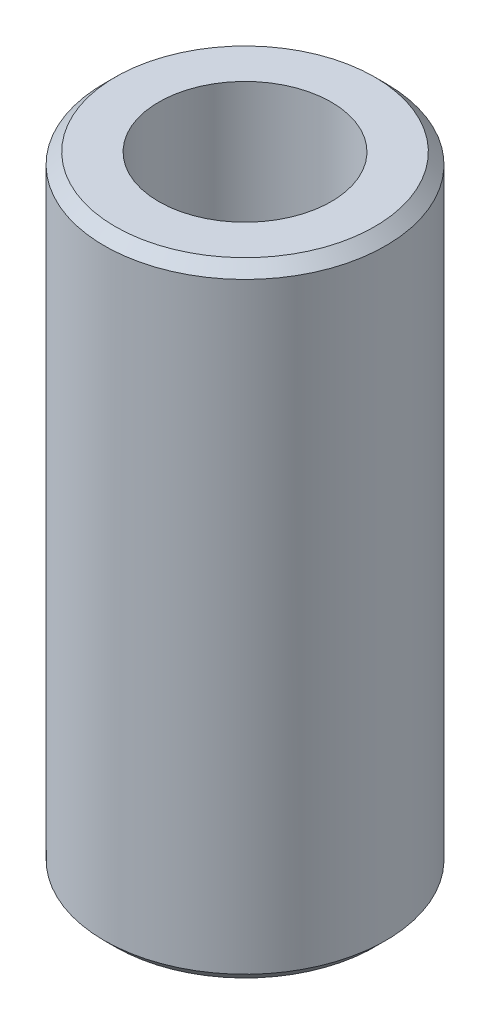
ISO-10303-21;
HEADER;
FILE_DESCRIPTION(('STEP AP214'),'2;1');
FILE_NAME('part.step','',(''),(''),'','','');
FILE_SCHEMA(('AUTOMOTIVE_DESIGN { 1 0 10303 214 1 1 1 1 }'));
ENDSEC;
DATA;
#1=APPLICATION_CONTEXT('core data for automotive mechanical design processes');
#2=APPLICATION_PROTOCOL_DEFINITION('international standard','automotive_design',2000,#1);
#3=PRODUCT_CONTEXT('',#1,'mechanical');
#4=PRODUCT('Part','Part','',(#3));
#5=PRODUCT_RELATED_PRODUCT_CATEGORY('part','',(#4));
#6=PRODUCT_DEFINITION_FORMATION('','',#4);
#7=PRODUCT_DEFINITION_CONTEXT('part definition',#1,'design');
#8=PRODUCT_DEFINITION('design','',#6,#7);
#9=PRODUCT_DEFINITION_SHAPE('','',#8);
#10=(LENGTH_UNIT() NAMED_UNIT(*) SI_UNIT(.MILLI.,.METRE.));
#11=(NAMED_UNIT(*) PLANE_ANGLE_UNIT() SI_UNIT($,.RADIAN.));
#12=(NAMED_UNIT(*) SI_UNIT($,.STERADIAN.) SOLID_ANGLE_UNIT());
#13=UNCERTAINTY_MEASURE_WITH_UNIT(LENGTH_MEASURE(1.E-05),#10,'distance_accuracy_value','');
#14=(GEOMETRIC_REPRESENTATION_CONTEXT(3) GLOBAL_UNCERTAINTY_ASSIGNED_CONTEXT((#13)) GLOBAL_UNIT_ASSIGNED_CONTEXT((#10,
#11,#12)) REPRESENTATION_CONTEXT('',''));
#15=CARTESIAN_POINT('',(0.,0.,0.));
#16=DIRECTION('',(0.,0.,1.));
#17=DIRECTION('',(1.,0.,0.));
#18=AXIS2_PLACEMENT_3D('',#15,#16,#17);
#19=CARTESIAN_POINT('',(0.,221.68163707225,0.));
#20=DIRECTION('',(0.,-1.,0.));
#21=DIRECTION('',(0.,0.,-1.));
#22=AXIS2_PLACEMENT_3D('',#19,#20,#21);
#23=CYLINDRICAL_SURFACE('',#22,50.);
#24=CARTESIAN_POINT('',(0.,217.753689113796,0.));
#25=DIRECTION('',(0.,1.,0.));
#26=DIRECTION('',(0.,0.,1.));
#27=AXIS2_PLACEMENT_3D('',#24,#25,#26);
#28=CIRCLE('',#27,50.);
#29=CARTESIAN_POINT('',(0.,217.753689113796,-50.));
#30=VERTEX_POINT('',#29);
#31=EDGE_CURVE('E50',#30,#30,#28,.F.);
#32=CARTESIAN_POINT('',(0.,3.92794795845428,0.));
#33=DIRECTION('',(0.,1.,0.));
#34=DIRECTION('',(0.,0.,1.));
#35=AXIS2_PLACEMENT_3D('',#32,#33,#34);
#36=CIRCLE('',#35,50.);
#37=CARTESIAN_POINT('',(0.,3.92794795845425,-50.));
#38=VERTEX_POINT('',#37);
#39=EDGE_CURVE('E51',#38,#38,#36,.T.);
#40=CARTESIAN_POINT('',(0.,217.753689113796,-50.));
#41=CARTESIAN_POINT('',(0.,215.526337643428,-50.));
#42=CARTESIAN_POINT('',(0.,213.29898617306,-50.));
#43=CARTESIAN_POINT('',(0.,208.844283232323,-50.));
#44=CARTESIAN_POINT('',(0.,206.616931761955,-50.));
#45=CARTESIAN_POINT('',(0.,202.162228821219,-50.));
#46=CARTESIAN_POINT('',(0.,199.934877350851,-50.));
#47=CARTESIAN_POINT('',(0.,195.480174410115,-50.));
#48=CARTESIAN_POINT('',(0.,193.252822939746,-50.));
#49=CARTESIAN_POINT('',(0.,188.79811999901,-50.));
#50=CARTESIAN_POINT('',(0.,186.570768528642,-50.));
#51=CARTESIAN_POINT('',(0.,182.116065587906,-50.));
#52=CARTESIAN_POINT('',(0.,179.888714117538,-50.));
#53=CARTESIAN_POINT('',(0.,175.434011176801,-50.));
#54=CARTESIAN_POINT('',(0.,173.206659706433,-50.));
#55=CARTESIAN_POINT('',(0.,168.751956765697,-50.));
#56=CARTESIAN_POINT('',(0.,166.524605295329,-50.));
#57=CARTESIAN_POINT('',(0.,162.069902354592,-50.));
#58=CARTESIAN_POINT('',(0.,159.842550884224,-50.));
#59=CARTESIAN_POINT('',(0.,155.387847943488,-50.));
#60=CARTESIAN_POINT('',(0.,153.16049647312,-50.));
#61=CARTESIAN_POINT('',(0.,148.705793532384,-50.));
#62=CARTESIAN_POINT('',(0.,146.478442062015,-50.));
#63=CARTESIAN_POINT('',(0.,142.023739121279,-50.));
#64=CARTESIAN_POINT('',(0.,139.796387650911,-50.));
#65=CARTESIAN_POINT('',(0.,135.341684710175,-50.));
#66=CARTESIAN_POINT('',(0.,133.114333239807,-50.));
#67=CARTESIAN_POINT('',(0.,128.65963029907,-50.));
#68=CARTESIAN_POINT('',(0.,126.432278828702,-50.));
#69=CARTESIAN_POINT('',(0.,121.977575887966,-50.));
#70=CARTESIAN_POINT('',(0.,119.750224417598,-50.));
#71=CARTESIAN_POINT('',(0.,115.295521476861,-50.));
#72=CARTESIAN_POINT('',(0.,113.068170006493,-50.));
#73=CARTESIAN_POINT('',(0.,108.613467065757,-50.));
#74=CARTESIAN_POINT('',(0.,106.386115595389,-50.));
#75=CARTESIAN_POINT('',(0.,101.931412654653,-50.));
#76=CARTESIAN_POINT('',(0.,99.7040611842844,-50.));
#77=CARTESIAN_POINT('',(0.,95.2493582435481,-50.));
#78=CARTESIAN_POINT('',(0.,93.02200677318,-50.));
#79=CARTESIAN_POINT('',(0.,88.5673038324437,-50.));
#80=CARTESIAN_POINT('',(0.,86.3399523620755,-50.));
#81=CARTESIAN_POINT('',(0.,81.8852494213393,-50.));
#82=CARTESIAN_POINT('',(0.,79.6578979509711,-50.));
#83=CARTESIAN_POINT('',(0.,75.2031950102348,-50.));
#84=CARTESIAN_POINT('',(0.,72.9758435398667,-50.));
#85=CARTESIAN_POINT('',(0.,68.5211405991304,-50.));
#86=CARTESIAN_POINT('',(0.,66.2937891287622,-50.));
#87=CARTESIAN_POINT('',(0.,61.839086188026,-50.));
#88=CARTESIAN_POINT('',(0.,59.6117347176578,-50.));
#89=CARTESIAN_POINT('',(0.,55.1570317769215,-50.));
#90=CARTESIAN_POINT('',(0.,52.9296803065534,-50.));
#91=CARTESIAN_POINT('',(0.,48.4749773658171,-50.));
#92=CARTESIAN_POINT('',(0.,46.247625895449,-50.));
#93=CARTESIAN_POINT('',(0.,41.7929229547127,-50.));
#94=CARTESIAN_POINT('',(0.,39.5655714843445,-50.));
#95=CARTESIAN_POINT('',(0.,35.1108685436082,-50.));
#96=CARTESIAN_POINT('',(0.,32.8835170732401,-50.));
#97=CARTESIAN_POINT('',(0.,28.4288141325038,-50.));
#98=CARTESIAN_POINT('',(0.,26.2014626621357,-50.));
#99=CARTESIAN_POINT('',(0.,21.7467597213994,-50.));
#100=CARTESIAN_POINT('',(0.,19.5194082510312,-50.));
#101=CARTESIAN_POINT('',(0.,15.064705310295,-50.));
#102=CARTESIAN_POINT('',(0.,12.8373538399268,-50.));
#103=CARTESIAN_POINT('',(0.,8.38265089919053,-50.));
#104=CARTESIAN_POINT('',(0.,6.15529942882239,-50.));
#105=CARTESIAN_POINT('',(0.,3.92794795845425,-50.));
#106=B_SPLINE_CURVE_WITH_KNOTS('',3,(#40,#41,#42,#43,#44,#45,#46,#47,#48,#49,#50,#51,#52,#53,
#54,#55,#56,#57,#58,#59,#60,#61,#62,#63,#64,#65,#66,#67,#68,#69,#70,#71,#72,#73,#74,#75,#76,#77,
#78,#79,#80,#81,#82,#83,#84,#85,#86,#87,#88,#89,#90,#91,#92,#93,#94,#95,#96,#97,#98,#99,#100,
#101,#102,#103,#104,#105),.UNSPECIFIED.,.F.,.F.,(4,2,2,2,2,2,2,2,2,2,2,2,2,2,2,2,2,2,2,2,2,2,2,
2,2,2,2,2,2,2,2,2,4),(0.,6.68205441110442,13.3641088222088,20.0461632333133,26.7282176444177,
33.4102720555221,40.0923264666266,46.774380877731,53.4564352888354,60.1384896999398,
66.8205441110442,73.5025985221487,80.1846529332531,86.8667073443575,93.548761755462,
100.230816166566,106.912870577671,113.594924988775,120.27697939988,126.959033810984,
133.641088222089,140.323142633193,147.005197044297,153.687251455402,160.369305866506,
167.051360277611,173.733414688715,180.41546909982,187.097523510924,193.779577922028,
200.461632333133,207.143686744237,213.825741155342),.UNSPECIFIED.);
#107=EDGE_CURVE('BSEAM39',#30,#38,#106,.T.);
#108=ORIENTED_EDGE('',*,*,#31,.T.);
#109=ORIENTED_EDGE('',*,*,#39,.T.);
#110=ORIENTED_EDGE('',*,*,#107,.T.);
#111=ORIENTED_EDGE('',*,*,#107,.F.);
#112=EDGE_LOOP('',(#108,#110,#109,#111));
#113=FACE_BOUND('',#112,.T.);
#114=ADVANCED_FACE('F39',(#113),#23,.T.);
#115=CARTESIAN_POINT('',(0.,221.68163707225,0.));
#116=DIRECTION('',(0.,1.,0.));
#117=DIRECTION('',(0.,0.,1.));
#118=AXIS2_PLACEMENT_3D('',#115,#116,#117);
#119=PLANE('',#118);
#120=CARTESIAN_POINT('',(0.,221.68163707225,0.));
#121=DIRECTION('',(0.,1.,0.));
#122=DIRECTION('',(0.,0.,1.));
#123=AXIS2_PLACEMENT_3D('',#120,#121,#122);
#124=CIRCLE('',#123,46.072052041546);
#125=CARTESIAN_POINT('',(0.,221.68163707225,46.072052041546));
#126=VERTEX_POINT('',#125);
#127=EDGE_CURVE('E54',#126,#126,#124,.T.);
#128=ORIENTED_EDGE('',*,*,#127,.T.);
#129=EDGE_LOOP('',(#128));
#130=FACE_BOUND('',#129,.T.);
#131=CARTESIAN_POINT('',(0.,221.68163707225,0.));
#132=DIRECTION('',(0.,1.,0.));
#133=DIRECTION('',(0.,0.,1.));
#134=AXIS2_PLACEMENT_3D('',#131,#132,#133);
#135=CIRCLE('',#134,30.6544891111135);
#136=CARTESIAN_POINT('',(0.,221.68163707225,-30.6544891111135));
#137=VERTEX_POINT('',#136);
#138=EDGE_CURVE('E58',#137,#137,#135,.T.);
#139=ORIENTED_EDGE('',*,*,#138,.F.);
#140=EDGE_LOOP('',(#139));
#141=FACE_BOUND('',#140,.T.);
#142=ADVANCED_FACE('F69',(#130,#141),#119,.T.);
#143=CARTESIAN_POINT('',(0.,0.,0.));
#144=DIRECTION('',(0.,1.,0.));
#145=DIRECTION('',(0.,0.,1.));
#146=AXIS2_PLACEMENT_3D('',#143,#144,#145);
#147=PLANE('',#146);
#148=CARTESIAN_POINT('',(0.,0.,0.));
#149=DIRECTION('',(0.,1.,0.));
#150=DIRECTION('',(0.,0.,1.));
#151=AXIS2_PLACEMENT_3D('',#148,#149,#150);
#152=CIRCLE('',#151,46.0720520415457);
#153=CARTESIAN_POINT('',(0.,0.,46.0720520415457));
#154=VERTEX_POINT('',#153);
#155=EDGE_CURVE('E10',#154,#154,#152,.F.);
#156=ORIENTED_EDGE('',*,*,#155,.T.);
#157=EDGE_LOOP('',(#156));
#158=FACE_BOUND('',#157,.T.);
#159=CARTESIAN_POINT('',(0.,0.,0.));
#160=DIRECTION('',(0.,1.,0.));
#161=DIRECTION('',(0.,0.,1.));
#162=AXIS2_PLACEMENT_3D('',#159,#160,#161);
#163=CIRCLE('',#162,30.6544891111135);
#164=CARTESIAN_POINT('',(0.,0.,-30.6544891111135));
#165=VERTEX_POINT('',#164);
#166=EDGE_CURVE('E63',#165,#165,#163,.T.);
#167=ORIENTED_EDGE('',*,*,#166,.T.);
#168=EDGE_LOOP('',(#167));
#169=FACE_BOUND('',#168,.T.);
#170=ADVANCED_FACE('F75',(#158,#169),#147,.F.);
#171=CARTESIAN_POINT('',(0.,221.68163707225,0.));
#172=DIRECTION('',(0.,-1.,0.));
#173=DIRECTION('',(0.,0.,-1.));
#174=AXIS2_PLACEMENT_3D('',#171,#172,#173);
#175=CYLINDRICAL_SURFACE('',#174,30.6544891111135);
#176=CARTESIAN_POINT('',(0.,221.68163707225,-30.6544891111135));
#177=CARTESIAN_POINT('',(0.,219.372453352747,-30.6544891111135));
#178=CARTESIAN_POINT('',(0.,217.063269633245,-30.6544891111135));
#179=CARTESIAN_POINT('',(0.,212.44490219424,-30.6544891111135));
#180=CARTESIAN_POINT('',(0.,210.135718474737,-30.6544891111135));
#181=CARTESIAN_POINT('',(0.,205.517351035732,-30.6544891111135));
#182=CARTESIAN_POINT('',(0.,203.208167316229,-30.6544891111135));
#183=CARTESIAN_POINT('',(0.,198.589799877224,-30.6544891111135));
#184=CARTESIAN_POINT('',(0.,196.280616157721,-30.6544891111135));
#185=CARTESIAN_POINT('',(0.,191.662248718716,-30.6544891111135));
#186=CARTESIAN_POINT('',(0.,189.353064999213,-30.6544891111135));
#187=CARTESIAN_POINT('',(0.,184.734697560208,-30.6544891111135));
#188=CARTESIAN_POINT('',(0.,182.425513840706,-30.6544891111135));
#189=CARTESIAN_POINT('',(0.,177.8071464017,-30.6544891111135));
#190=CARTESIAN_POINT('',(0.,175.497962682198,-30.6544891111135));
#191=CARTESIAN_POINT('',(0.,170.879595243193,-30.6544891111135));
#192=CARTESIAN_POINT('',(0.,168.57041152369,-30.6544891111135));
#193=CARTESIAN_POINT('',(0.,163.952044084685,-30.6544891111135));
#194=CARTESIAN_POINT('',(0.,161.642860365182,-30.6544891111135));
#195=CARTESIAN_POINT('',(0.,157.024492926177,-30.6544891111135));
#196=CARTESIAN_POINT('',(0.,154.715309206674,-30.6544891111135));
#197=CARTESIAN_POINT('',(0.,150.096941767669,-30.6544891111135));
#198=CARTESIAN_POINT('',(0.,147.787758048167,-30.6544891111135));
#199=CARTESIAN_POINT('',(0.,143.169390609161,-30.6544891111135));
#200=CARTESIAN_POINT('',(0.,140.860206889659,-30.6544891111135));
#201=CARTESIAN_POINT('',(0.,136.241839450654,-30.6544891111135));
#202=CARTESIAN_POINT('',(0.,133.932655731151,-30.6544891111135));
#203=CARTESIAN_POINT('',(0.,129.314288292146,-30.6544891111135));
#204=CARTESIAN_POINT('',(0.,127.005104572643,-30.6544891111135));
#205=CARTESIAN_POINT('',(0.,122.386737133638,-30.6544891111135));
#206=CARTESIAN_POINT('',(0.,120.077553414135,-30.6544891111135));
#207=CARTESIAN_POINT('',(0.,115.45918597513,-30.6544891111135));
#208=CARTESIAN_POINT('',(0.,113.150002255628,-30.6544891111135));
#209=CARTESIAN_POINT('',(0.,108.531634816622,-30.6544891111135));
#210=CARTESIAN_POINT('',(0.,106.22245109712,-30.6544891111135));
#211=CARTESIAN_POINT('',(0.,101.604083658115,-30.6544891111135));
#212=CARTESIAN_POINT('',(0.,99.2948999386119,-30.6544891111135));
#213=CARTESIAN_POINT('',(0.,94.6765324996067,-30.6544891111135));
#214=CARTESIAN_POINT('',(0.,92.3673487801042,-30.6544891111135));
#215=CARTESIAN_POINT('',(0.,87.7489813410989,-30.6544891111135));
#216=CARTESIAN_POINT('',(0.,85.4397976215964,-30.6544891111135));
#217=CARTESIAN_POINT('',(0.,80.8214301825911,-30.6544891111135));
#218=CARTESIAN_POINT('',(0.,78.5122464630885,-30.6544891111135));
#219=CARTESIAN_POINT('',(0.,73.8938790240833,-30.6544891111135));
#220=CARTESIAN_POINT('',(0.,71.5846953045807,-30.6544891111135));
#221=CARTESIAN_POINT('',(0.,66.9663278655755,-30.6544891111135));
#222=CARTESIAN_POINT('',(0.,64.6571441460729,-30.6544891111135));
#223=CARTESIAN_POINT('',(0.,60.0387767070677,-30.6544891111135));
#224=CARTESIAN_POINT('',(0.,57.7295929875651,-30.6544891111135));
#225=CARTESIAN_POINT('',(0.,53.1112255485599,-30.6544891111135));
#226=CARTESIAN_POINT('',(0.,50.8020418290573,-30.6544891111135));
#227=CARTESIAN_POINT('',(0.,46.1836743900521,-30.6544891111135));
#228=CARTESIAN_POINT('',(0.,43.8744906705495,-30.6544891111135));
#229=CARTESIAN_POINT('',(0.,39.2561232315443,-30.6544891111135));
#230=CARTESIAN_POINT('',(0.,36.9469395120417,-30.6544891111135));
#231=CARTESIAN_POINT('',(0.,32.3285720730364,-30.6544891111135));
#232=CARTESIAN_POINT('',(0.,30.0193883535338,-30.6544891111135));
#233=CARTESIAN_POINT('',(0.,25.4010209145286,-30.6544891111135));
#234=CARTESIAN_POINT('',(0.,23.091837195026,-30.6544891111135));
#235=CARTESIAN_POINT('',(0.,18.4734697560208,-30.6544891111135));
#236=CARTESIAN_POINT('',(0.,16.1642860365182,-30.6544891111135));
#237=CARTESIAN_POINT('',(0.,11.545918597513,-30.6544891111135));
#238=CARTESIAN_POINT('',(0.,9.23673487801042,-30.6544891111135));
#239=CARTESIAN_POINT('',(0.,4.61836743900521,-30.6544891111135));
#240=CARTESIAN_POINT('',(0.,2.30918371950261,-30.6544891111135));
#241=CARTESIAN_POINT('',(0.,0.,-30.6544891111135));
#242=B_SPLINE_CURVE_WITH_KNOTS('',3,(#176,#177,#178,#179,#180,#181,#182,#183,#184,#185,#186,
#187,#188,#189,#190,#191,#192,#193,#194,#195,#196,#197,#198,#199,#200,#201,#202,#203,#204,#205,
#206,#207,#208,#209,#210,#211,#212,#213,#214,#215,#216,#217,#218,#219,#220,#221,#222,#223,#224,
#225,#226,#227,#228,#229,#230,#231,#232,#233,#234,#235,#236,#237,#238,#239,#240,#241),
.UNSPECIFIED.,.F.,.F.,(4,2,2,2,2,2,2,2,2,2,2,2,2,2,2,2,2,2,2,2,2,2,2,2,2,2,2,2,2,2,2,2,4),(0.,
6.92755115850782,13.8551023170156,20.7826534755234,27.7102046340313,34.6377557925391,
41.5653069510469,48.4928581095547,55.4204092680625,62.3479604265703,69.2755115850781,
76.2030627435859,83.1306139020937,90.0581650606016,96.9857162191094,103.913267377617,
110.840818536125,117.768369694633,124.695920853141,131.623472011648,138.551023170156,
145.478574328664,152.406125487172,159.33367664568,166.261227804187,173.188778962695,
180.116330121203,187.043881279711,193.971432438219,200.898983596727,207.826534755234,
214.754085913742,221.68163707225),.UNSPECIFIED.);
#243=EDGE_CURVE('BSEAM70',#137,#165,#242,.T.);
#244=ORIENTED_EDGE('',*,*,#138,.T.);
#245=ORIENTED_EDGE('',*,*,#166,.F.);
#246=ORIENTED_EDGE('',*,*,#243,.T.);
#247=ORIENTED_EDGE('',*,*,#243,.F.);
#248=EDGE_LOOP('',(#244,#246,#245,#247));
#249=FACE_BOUND('',#248,.T.);
#250=ADVANCED_FACE('F70',(#249),#175,.F.);
#251=CARTESIAN_POINT('',(0.,221.68163707225,0.));
#252=DIRECTION('',(0.,-1.,0.));
#253=DIRECTION('',(0.,0.,-1.));
#254=AXIS2_PLACEMENT_3D('',#251,#252,#253);
#255=CONICAL_SURFACE('',#254,46.072052041546,0.785398163397447);
#256=ORIENTED_EDGE('',*,*,#31,.F.);
#257=EDGE_LOOP('',(#256));
#258=FACE_BOUND('',#257,.T.);
#259=ORIENTED_EDGE('',*,*,#127,.F.);
#260=EDGE_LOOP('',(#259));
#261=FACE_BOUND('',#260,.T.);
#262=ADVANCED_FACE('F81',(#258,#261),#255,.T.);
#263=CARTESIAN_POINT('',(0.,3.92794795845428,0.));
#264=DIRECTION('',(0.,1.,0.));
#265=DIRECTION('',(0.,0.,1.));
#266=AXIS2_PLACEMENT_3D('',#263,#264,#265);
#267=CONICAL_SURFACE('',#266,50.,0.785398163397451);
#268=ORIENTED_EDGE('',*,*,#155,.F.);
#269=EDGE_LOOP('',(#268));
#270=FACE_BOUND('',#269,.T.);
#271=ORIENTED_EDGE('',*,*,#39,.F.);
#272=EDGE_LOOP('',(#271));
#273=FACE_BOUND('',#272,.T.);
#274=ADVANCED_FACE('F45',(#270,#273),#267,.T.);
#275=CLOSED_SHELL('',(#114,#142,#170,#250,#262,#274));
#276=MANIFOLD_SOLID_BREP('B2',#275);
#277=ADVANCED_BREP_SHAPE_REPRESENTATION('',(#18,#276),#14);
#278=SHAPE_DEFINITION_REPRESENTATION(#9,#277);
ENDSEC;
END-ISO-10303-21;
